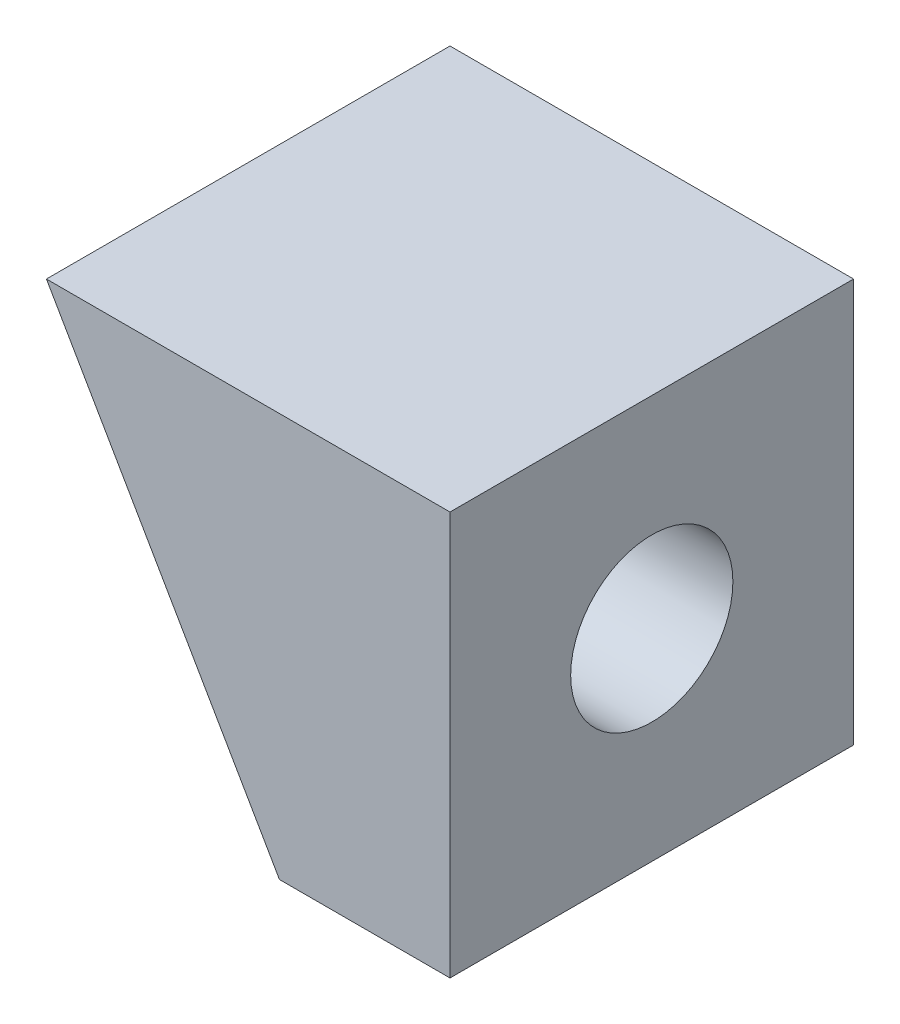
ISO-10303-21;
HEADER;
FILE_DESCRIPTION(('STEP AP214'),'2;1');
FILE_NAME('part.step','',(''),(''),'','','');
FILE_SCHEMA(('AUTOMOTIVE_DESIGN { 1 0 10303 214 1 1 1 1 }'));
ENDSEC;
DATA;
#1=APPLICATION_CONTEXT('core data for automotive mechanical design processes');
#2=APPLICATION_PROTOCOL_DEFINITION('international standard','automotive_design',2000,#1);
#3=PRODUCT_CONTEXT('',#1,'mechanical');
#4=PRODUCT('Part','Part','',(#3));
#5=PRODUCT_RELATED_PRODUCT_CATEGORY('part','',(#4));
#6=PRODUCT_DEFINITION_FORMATION('','',#4);
#7=PRODUCT_DEFINITION_CONTEXT('part definition',#1,'design');
#8=PRODUCT_DEFINITION('design','',#6,#7);
#9=PRODUCT_DEFINITION_SHAPE('','',#8);
#10=(LENGTH_UNIT() NAMED_UNIT(*) SI_UNIT(.MILLI.,.METRE.));
#11=(NAMED_UNIT(*) PLANE_ANGLE_UNIT() SI_UNIT($,.RADIAN.));
#12=(NAMED_UNIT(*) SI_UNIT($,.STERADIAN.) SOLID_ANGLE_UNIT());
#13=UNCERTAINTY_MEASURE_WITH_UNIT(LENGTH_MEASURE(1.E-05),#10,'distance_accuracy_value','');
#14=(GEOMETRIC_REPRESENTATION_CONTEXT(3) GLOBAL_UNCERTAINTY_ASSIGNED_CONTEXT((#13)) GLOBAL_UNIT_ASSIGNED_CONTEXT((#10,
#11,#12)) REPRESENTATION_CONTEXT('',''));
#15=CARTESIAN_POINT('',(0.,0.,0.));
#16=DIRECTION('',(0.,0.,1.));
#17=DIRECTION('',(1.,0.,0.));
#18=AXIS2_PLACEMENT_3D('',#15,#16,#17);
#19=CARTESIAN_POINT('',(12.7,0.,0.));
#20=DIRECTION('',(0.,0.,-1.));
#21=DIRECTION('',(0.,1.,0.));
#22=AXIS2_PLACEMENT_3D('',#19,#20,#21);
#23=PLANE('',#22);
#24=DIRECTION('',(0.500000000000001,-0.866025403784438,0.));
#25=VECTOR('',#24,1.);
#26=CARTESIAN_POINT('',(5.4992613140312,3.17500000000002,0.));
#27=LINE('',#26,#25);
#28=CARTESIAN_POINT('',(0.,12.7,0.));
#29=VERTEX_POINT('',#28);
#30=CARTESIAN_POINT('',(7.33234841870827,0.,0.));
#31=VERTEX_POINT('',#30);
#32=EDGE_CURVE('E75',#29,#31,#27,.T.);
#33=ORIENTED_EDGE('',*,*,#32,.T.);
#34=DIRECTION('',(-1.,0.,0.));
#35=VECTOR('',#34,1.);
#36=CARTESIAN_POINT('',(12.7,0.,0.));
#37=LINE('',#36,#35);
#38=CARTESIAN_POINT('',(12.7,0.,0.));
#39=VERTEX_POINT('',#38);
#40=EDGE_CURVE('E11',#39,#31,#37,.T.);
#41=ORIENTED_EDGE('',*,*,#40,.F.);
#42=DIRECTION('',(0.,-1.,0.));
#43=VECTOR('',#42,1.);
#44=CARTESIAN_POINT('',(12.7,0.,0.));
#45=LINE('',#44,#43);
#46=CARTESIAN_POINT('',(12.7,12.7,0.));
#47=VERTEX_POINT('',#46);
#48=EDGE_CURVE('E79',#47,#39,#45,.T.);
#49=ORIENTED_EDGE('',*,*,#48,.F.);
#50=DIRECTION('',(-1.,0.,0.));
#51=VECTOR('',#50,1.);
#52=CARTESIAN_POINT('',(12.7,12.7,0.));
#53=LINE('',#52,#51);
#54=EDGE_CURVE('E91',#47,#29,#53,.T.);
#55=ORIENTED_EDGE('',*,*,#54,.T.);
#56=EDGE_LOOP('',(#33,#41,#49,#55));
#57=FACE_BOUND('',#56,.T.);
#58=ADVANCED_FACE('F33',(#57),#23,.F.);
#59=CARTESIAN_POINT('',(12.7,0.,0.));
#60=DIRECTION('',(0.,1.,0.));
#61=DIRECTION('',(0.,0.,1.));
#62=AXIS2_PLACEMENT_3D('',#59,#60,#61);
#63=PLANE('',#62);
#64=DIRECTION('',(0.,0.,1.));
#65=VECTOR('',#64,1.);
#66=CARTESIAN_POINT('',(7.33234841870827,0.,-12.7));
#67=LINE('',#66,#65);
#68=CARTESIAN_POINT('',(7.33234841870827,0.,-12.7));
#69=VERTEX_POINT('',#68);
#70=EDGE_CURVE('E80',#69,#31,#67,.T.);
#71=ORIENTED_EDGE('',*,*,#70,.F.);
#72=DIRECTION('',(-1.,0.,0.));
#73=VECTOR('',#72,1.);
#74=CARTESIAN_POINT('',(12.7,0.,-12.7));
#75=LINE('',#74,#73);
#76=CARTESIAN_POINT('',(12.7,0.,-12.7));
#77=VERTEX_POINT('',#76);
#78=EDGE_CURVE('E41',#77,#69,#75,.T.);
#79=ORIENTED_EDGE('',*,*,#78,.F.);
#80=DIRECTION('',(0.,0.,-1.));
#81=VECTOR('',#80,1.);
#82=CARTESIAN_POINT('',(12.7,0.,0.));
#83=LINE('',#82,#81);
#84=EDGE_CURVE('E98',#39,#77,#83,.T.);
#85=ORIENTED_EDGE('',*,*,#84,.F.);
#86=ORIENTED_EDGE('',*,*,#40,.T.);
#87=EDGE_LOOP('',(#71,#79,#85,#86));
#88=FACE_BOUND('',#87,.T.);
#89=ADVANCED_FACE('F119',(#88),#63,.F.);
#90=CARTESIAN_POINT('',(12.7,0.,-12.7));
#91=DIRECTION('',(0.,0.,1.));
#92=DIRECTION('',(0.,-1.,0.));
#93=AXIS2_PLACEMENT_3D('',#90,#91,#92);
#94=PLANE('',#93);
#95=DIRECTION('',(0.500000000000001,-0.866025403784438,0.));
#96=VECTOR('',#95,1.);
#97=CARTESIAN_POINT('',(5.4992613140312,3.17500000000002,-12.7));
#98=LINE('',#97,#96);
#99=CARTESIAN_POINT('',(0.,12.7,-12.7));
#100=VERTEX_POINT('',#99);
#101=EDGE_CURVE('E72',#100,#69,#98,.T.);
#102=ORIENTED_EDGE('',*,*,#101,.F.);
#103=DIRECTION('',(-1.,0.,0.));
#104=VECTOR('',#103,1.);
#105=CARTESIAN_POINT('',(12.7,12.7,-12.7));
#106=LINE('',#105,#104);
#107=CARTESIAN_POINT('',(12.7,12.7,-12.7));
#108=VERTEX_POINT('',#107);
#109=EDGE_CURVE('E87',#108,#100,#106,.T.);
#110=ORIENTED_EDGE('',*,*,#109,.F.);
#111=DIRECTION('',(0.,1.,0.));
#112=VECTOR('',#111,1.);
#113=CARTESIAN_POINT('',(12.7,0.,-12.7));
#114=LINE('',#113,#112);
#115=EDGE_CURVE('E96',#77,#108,#114,.T.);
#116=ORIENTED_EDGE('',*,*,#115,.F.);
#117=ORIENTED_EDGE('',*,*,#78,.T.);
#118=EDGE_LOOP('',(#102,#110,#116,#117));
#119=FACE_BOUND('',#118,.T.);
#120=ADVANCED_FACE('F85',(#119),#94,.F.);
#121=CARTESIAN_POINT('',(12.7,12.7,0.));
#122=DIRECTION('',(0.,-1.,0.));
#123=DIRECTION('',(0.,0.,-1.));
#124=AXIS2_PLACEMENT_3D('',#121,#122,#123);
#125=PLANE('',#124);
#126=DIRECTION('',(0.,0.,1.));
#127=VECTOR('',#126,1.);
#128=CARTESIAN_POINT('',(0.,12.7,0.));
#129=LINE('',#128,#127);
#130=EDGE_CURVE('E69',#100,#29,#129,.T.);
#131=ORIENTED_EDGE('',*,*,#130,.T.);
#132=ORIENTED_EDGE('',*,*,#54,.F.);
#133=DIRECTION('',(0.,0.,1.));
#134=VECTOR('',#133,1.);
#135=CARTESIAN_POINT('',(12.7,12.7,0.));
#136=LINE('',#135,#134);
#137=EDGE_CURVE('E48',#108,#47,#136,.T.);
#138=ORIENTED_EDGE('',*,*,#137,.F.);
#139=ORIENTED_EDGE('',*,*,#109,.T.);
#140=EDGE_LOOP('',(#131,#132,#138,#139));
#141=FACE_BOUND('',#140,.T.);
#142=ADVANCED_FACE('F90',(#141),#125,.F.);
#143=CARTESIAN_POINT('',(12.7,0.,0.));
#144=DIRECTION('',(-1.,0.,0.));
#145=DIRECTION('',(0.,0.,1.));
#146=AXIS2_PLACEMENT_3D('',#143,#144,#145);
#147=PLANE('',#146);
#148=CARTESIAN_POINT('',(12.7,6.35,-6.35));
#149=DIRECTION('',(1.,0.,0.));
#150=DIRECTION('',(0.,0.,-1.));
#151=AXIS2_PLACEMENT_3D('',#148,#149,#150);
#152=CIRCLE('',#151,2.5527);
#153=CARTESIAN_POINT('',(12.7,6.35,-8.9027));
#154=VERTEX_POINT('',#153);
#155=EDGE_CURVE('E106',#154,#154,#152,.T.);
#156=ORIENTED_EDGE('',*,*,#155,.F.);
#157=EDGE_LOOP('',(#156));
#158=FACE_BOUND('',#157,.T.);
#159=ORIENTED_EDGE('',*,*,#48,.T.);
#160=ORIENTED_EDGE('',*,*,#84,.T.);
#161=ORIENTED_EDGE('',*,*,#115,.T.);
#162=ORIENTED_EDGE('',*,*,#137,.T.);
#163=EDGE_LOOP('',(#159,#160,#161,#162));
#164=FACE_BOUND('',#163,.T.);
#165=ADVANCED_FACE('F112',(#158,#164),#147,.F.);
#166=CARTESIAN_POINT('',(5.4992613140312,3.17500000000002,-12.7));
#167=DIRECTION('',(-0.866025403784438,-0.500000000000001,0.));
#168=DIRECTION('',(0.500000000000001,-0.866025403784438,0.));
#169=AXIS2_PLACEMENT_3D('',#166,#167,#168);
#170=PLANE('',#169);
#171=CARTESIAN_POINT('',(3.66617420935414,6.35,-6.35));
#172=DIRECTION('',(-0.866025403784438,-0.500000000000001,0.));
#173=DIRECTION('',(0.500000000000001,-0.866025403784438,0.));
#174=AXIS2_PLACEMENT_3D('',#171,#172,#173);
#175=ELLIPSE('',#174,2.94760406432072,2.5527);
#176=CARTESIAN_POINT('',(5.1399762415145,3.7973,-6.35));
#177=VERTEX_POINT('',#176);
#178=EDGE_CURVE('E102',#177,#177,#175,.T.);
#179=ORIENTED_EDGE('',*,*,#178,.F.);
#180=EDGE_LOOP('',(#179));
#181=FACE_BOUND('',#180,.T.);
#182=ORIENTED_EDGE('',*,*,#32,.F.);
#183=ORIENTED_EDGE('',*,*,#130,.F.);
#184=ORIENTED_EDGE('',*,*,#101,.T.);
#185=ORIENTED_EDGE('',*,*,#70,.T.);
#186=EDGE_LOOP('',(#182,#183,#184,#185));
#187=FACE_BOUND('',#186,.T.);
#188=ADVANCED_FACE('F71',(#181,#187),#170,.T.);
#189=CARTESIAN_POINT('',(12.7,6.35,-6.35));
#190=DIRECTION('',(1.,0.,0.));
#191=DIRECTION('',(0.,0.,-1.));
#192=AXIS2_PLACEMENT_3D('',#189,#190,#191);
#193=CYLINDRICAL_SURFACE('',#192,2.5527);
#194=ORIENTED_EDGE('',*,*,#178,.T.);
#195=EDGE_LOOP('',(#194));
#196=FACE_BOUND('',#195,.T.);
#197=ORIENTED_EDGE('',*,*,#155,.T.);
#198=EDGE_LOOP('',(#197));
#199=FACE_BOUND('',#198,.T.);
#200=ADVANCED_FACE('F110',(#196,#199),#193,.F.);
#201=CLOSED_SHELL('',(#58,#89,#120,#142,#165,#188,#200));
#202=MANIFOLD_SOLID_BREP('B2',#201);
#203=ADVANCED_BREP_SHAPE_REPRESENTATION('',(#18,#202),#14);
#204=SHAPE_DEFINITION_REPRESENTATION(#9,#203);
ENDSEC;
END-ISO-10303-21;
